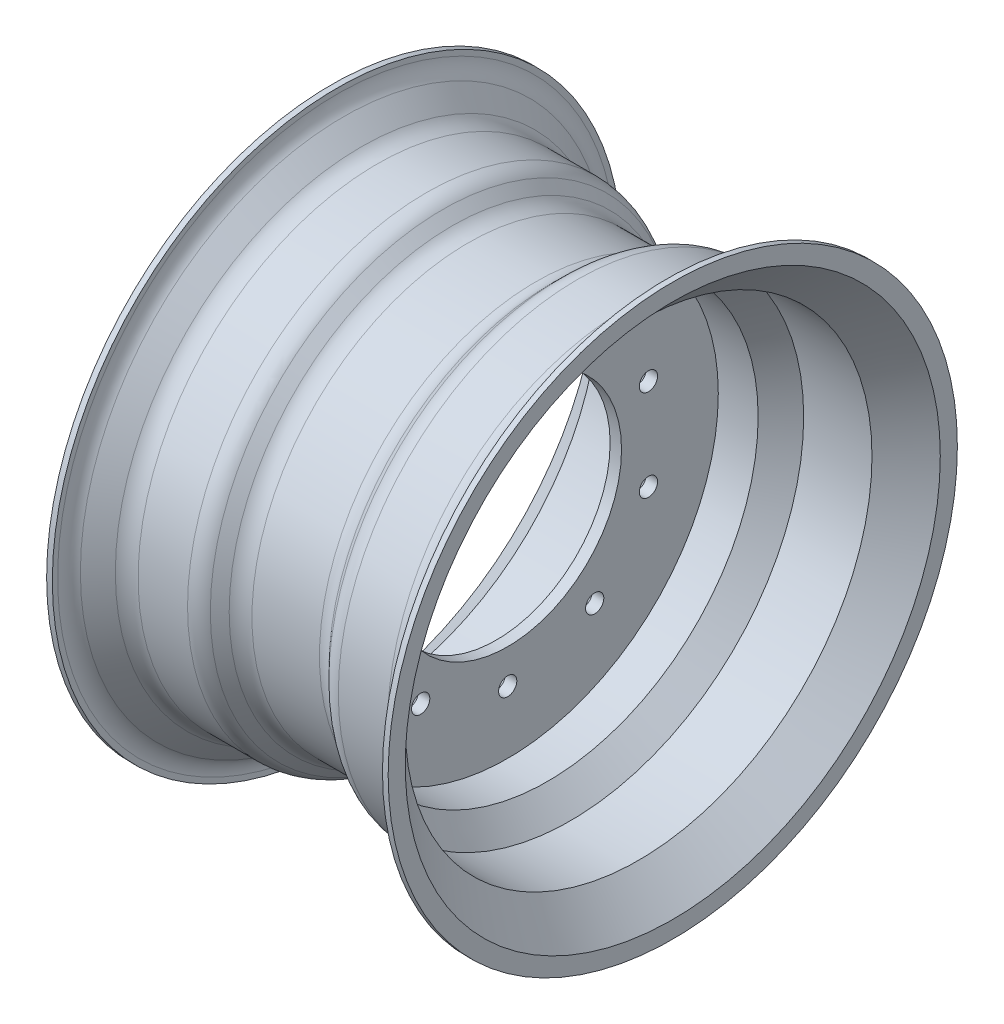
ISO-10303-21;
HEADER;
FILE_DESCRIPTION(('STEP AP214'),'2;1');
FILE_NAME('part.step','',(''),(''),'','','');
FILE_SCHEMA(('AUTOMOTIVE_DESIGN { 1 0 10303 214 1 1 1 1 }'));
ENDSEC;
DATA;
#1=APPLICATION_CONTEXT('core data for automotive mechanical design processes');
#2=APPLICATION_PROTOCOL_DEFINITION('international standard','automotive_design',2000,#1);
#3=PRODUCT_CONTEXT('',#1,'mechanical');
#4=PRODUCT('Part','Part','',(#3));
#5=PRODUCT_RELATED_PRODUCT_CATEGORY('part','',(#4));
#6=PRODUCT_DEFINITION_FORMATION('','',#4);
#7=PRODUCT_DEFINITION_CONTEXT('part definition',#1,'design');
#8=PRODUCT_DEFINITION('design','',#6,#7);
#9=PRODUCT_DEFINITION_SHAPE('','',#8);
#10=(LENGTH_UNIT() NAMED_UNIT(*) SI_UNIT(.MILLI.,.METRE.));
#11=(NAMED_UNIT(*) PLANE_ANGLE_UNIT() SI_UNIT($,.RADIAN.));
#12=(NAMED_UNIT(*) SI_UNIT($,.STERADIAN.) SOLID_ANGLE_UNIT());
#13=UNCERTAINTY_MEASURE_WITH_UNIT(LENGTH_MEASURE(1.E-05),#10,'distance_accuracy_value','');
#14=(GEOMETRIC_REPRESENTATION_CONTEXT(3) GLOBAL_UNCERTAINTY_ASSIGNED_CONTEXT((#13)) GLOBAL_UNIT_ASSIGNED_CONTEXT((#10,
#11,#12)) REPRESENTATION_CONTEXT('',''));
#15=CARTESIAN_POINT('',(0.,0.,0.));
#16=DIRECTION('',(0.,0.,1.));
#17=DIRECTION('',(1.,0.,0.));
#18=AXIS2_PLACEMENT_3D('',#15,#16,#17);
#19=CARTESIAN_POINT('',(0.,0.,0.));
#20=DIRECTION('',(1.,0.,0.));
#21=DIRECTION('',(0.,0.,-1.));
#22=AXIS2_PLACEMENT_3D('',#19,#20,#21);
#23=CYLINDRICAL_SURFACE('',#22,250.);
#24=CARTESIAN_POINT('',(-150.,0.,0.));
#25=DIRECTION('',(1.,0.,0.));
#26=DIRECTION('',(0.,0.,-1.));
#27=AXIS2_PLACEMENT_3D('',#24,#25,#26);
#28=CIRCLE('',#27,250.);
#29=CARTESIAN_POINT('',(-150.,0.,-250.));
#30=VERTEX_POINT('',#29);
#31=EDGE_CURVE('E62',#30,#30,#28,.T.);
#32=ORIENTED_EDGE('',*,*,#31,.T.);
#33=EDGE_LOOP('',(#32));
#34=FACE_BOUND('',#33,.T.);
#35=CARTESIAN_POINT('',(-145.,0.,0.));
#36=DIRECTION('',(1.,0.,0.));
#37=DIRECTION('',(0.,0.,-1.));
#38=AXIS2_PLACEMENT_3D('',#35,#36,#37);
#39=CIRCLE('',#38,250.);
#40=CARTESIAN_POINT('',(-145.,0.,-250.));
#41=VERTEX_POINT('',#40);
#42=EDGE_CURVE('E168',#41,#41,#39,.T.);
#43=ORIENTED_EDGE('',*,*,#42,.F.);
#44=EDGE_LOOP('',(#43));
#45=FACE_BOUND('',#44,.T.);
#46=ADVANCED_FACE('F39',(#34,#45),#23,.T.);
#47=CARTESIAN_POINT('',(-145.,250.,0.));
#48=DIRECTION('',(1.,0.,0.));
#49=DIRECTION('',(0.,0.,-1.));
#50=AXIS2_PLACEMENT_3D('',#47,#48,#49);
#51=PLANE('',#50);
#52=CARTESIAN_POINT('',(-145.,0.,0.));
#53=DIRECTION('',(1.,0.,0.));
#54=DIRECTION('',(0.,0.,-1.));
#55=AXIS2_PLACEMENT_3D('',#52,#53,#54);
#56=CIRCLE('',#55,245.355339059327);
#57=CARTESIAN_POINT('',(-145.,0.,-245.355339059327));
#58=VERTEX_POINT('',#57);
#59=EDGE_CURVE('E10',#58,#58,#56,.F.);
#60=ORIENTED_EDGE('',*,*,#59,.T.);
#61=EDGE_LOOP('',(#60));
#62=FACE_BOUND('',#61,.T.);
#63=ORIENTED_EDGE('',*,*,#42,.T.);
#64=EDGE_LOOP('',(#63));
#65=FACE_BOUND('',#64,.T.);
#66=ADVANCED_FACE('F243',(#62,#65),#51,.T.);
#67=CARTESIAN_POINT('',(-117.928932188134,0.,0.));
#68=DIRECTION('',(-1.,0.,0.));
#69=DIRECTION('',(0.,0.,1.));
#70=AXIS2_PLACEMENT_3D('',#67,#68,#69);
#71=CONICAL_SURFACE('',#70,210.,0.785398163397445);
#72=CARTESIAN_POINT('',(-123.786796564404,0.,0.));
#73=DIRECTION('',(-1.,0.,0.));
#74=DIRECTION('',(0.,0.,1.));
#75=AXIS2_PLACEMENT_3D('',#72,#73,#74);
#76=CIRCLE('',#75,215.857864376269);
#77=CARTESIAN_POINT('',(-123.786796564404,0.,215.857864376269));
#78=VERTEX_POINT('',#77);
#79=EDGE_CURVE('E48',#78,#78,#76,.T.);
#80=ORIENTED_EDGE('',*,*,#79,.T.);
#81=EDGE_LOOP('',(#80));
#82=FACE_BOUND('',#81,.T.);
#83=CARTESIAN_POINT('',(-139.142135623731,0.,0.));
#84=DIRECTION('',(-1.,0.,0.));
#85=DIRECTION('',(0.,0.,1.));
#86=AXIS2_PLACEMENT_3D('',#83,#84,#85);
#87=CIRCLE('',#86,231.213203435596);
#88=CARTESIAN_POINT('',(-139.142135623731,0.,231.213203435596));
#89=VERTEX_POINT('',#88);
#90=EDGE_CURVE('E54',#89,#89,#87,.F.);
#91=ORIENTED_EDGE('',*,*,#90,.T.);
#92=EDGE_LOOP('',(#91));
#93=FACE_BOUND('',#92,.T.);
#94=ADVANCED_FACE('F227',(#82,#93),#71,.T.);
#95=CARTESIAN_POINT('',(0.,0.,0.));
#96=DIRECTION('',(1.,0.,0.));
#97=DIRECTION('',(0.,0.,-1.));
#98=AXIS2_PLACEMENT_3D('',#95,#96,#97);
#99=CYLINDRICAL_SURFACE('',#98,210.);
#100=CARTESIAN_POINT('',(-66.2132034355964,0.,0.));
#101=DIRECTION('',(-1.,0.,0.));
#102=DIRECTION('',(0.,0.,1.));
#103=AXIS2_PLACEMENT_3D('',#100,#101,#102);
#104=CIRCLE('',#103,210.);
#105=CARTESIAN_POINT('',(-66.2132034355964,0.,210.));
#106=VERTEX_POINT('',#105);
#107=EDGE_CURVE('E220',#106,#106,#104,.T.);
#108=ORIENTED_EDGE('',*,*,#107,.T.);
#109=EDGE_LOOP('',(#108));
#110=FACE_BOUND('',#109,.T.);
#111=CARTESIAN_POINT('',(-109.644660940673,0.,0.));
#112=DIRECTION('',(1.,0.,0.));
#113=DIRECTION('',(0.,0.,-1.));
#114=AXIS2_PLACEMENT_3D('',#111,#112,#113);
#115=CIRCLE('',#114,210.);
#116=CARTESIAN_POINT('',(-109.644660940673,0.,-210.));
#117=VERTEX_POINT('',#116);
#118=EDGE_CURVE('E216',#117,#117,#115,.T.);
#119=ORIENTED_EDGE('',*,*,#118,.T.);
#120=EDGE_LOOP('',(#119));
#121=FACE_BOUND('',#120,.T.);
#122=ADVANCED_FACE('F285',(#110,#121),#99,.T.);
#123=CARTESIAN_POINT('',(-37.9289321881345,0.,0.));
#124=DIRECTION('',(-1.,0.,0.));
#125=DIRECTION('',(0.,0.,1.));
#126=AXIS2_PLACEMENT_3D('',#123,#124,#125);
#127=CONICAL_SURFACE('',#126,190.,0.785398163397448);
#128=CARTESIAN_POINT('',(-43.7867965644036,0.,0.));
#129=DIRECTION('',(-1.,0.,0.));
#130=DIRECTION('',(0.,0.,1.));
#131=AXIS2_PLACEMENT_3D('',#128,#129,#130);
#132=CIRCLE('',#131,195.857864376269);
#133=CARTESIAN_POINT('',(-43.7867965644036,0.,195.857864376269));
#134=VERTEX_POINT('',#133);
#135=EDGE_CURVE('E212',#134,#134,#132,.T.);
#136=ORIENTED_EDGE('',*,*,#135,.T.);
#137=EDGE_LOOP('',(#136));
#138=FACE_BOUND('',#137,.T.);
#139=CARTESIAN_POINT('',(-52.0710678118655,0.,0.));
#140=DIRECTION('',(1.,0.,0.));
#141=DIRECTION('',(0.,0.,-1.));
#142=AXIS2_PLACEMENT_3D('',#139,#140,#141);
#143=CIRCLE('',#142,204.142135623731);
#144=CARTESIAN_POINT('',(-52.0710678118655,0.,-204.142135623731));
#145=VERTEX_POINT('',#144);
#146=EDGE_CURVE('E208',#145,#145,#143,.T.);
#147=ORIENTED_EDGE('',*,*,#146,.T.);
#148=EDGE_LOOP('',(#147));
#149=FACE_BOUND('',#148,.T.);
#150=ADVANCED_FACE('F282',(#138,#149),#127,.T.);
#151=CARTESIAN_POINT('',(0.,0.,0.));
#152=DIRECTION('',(1.,0.,0.));
#153=DIRECTION('',(0.,0.,-1.));
#154=AXIS2_PLACEMENT_3D('',#151,#152,#153);
#155=CYLINDRICAL_SURFACE('',#154,190.);
#156=CARTESIAN_POINT('',(29.6446609406726,0.,0.));
#157=DIRECTION('',(1.,0.,0.));
#158=DIRECTION('',(0.,0.,-1.));
#159=AXIS2_PLACEMENT_3D('',#156,#157,#158);
#160=CIRCLE('',#159,190.);
#161=CARTESIAN_POINT('',(29.6446609406726,0.,-190.));
#162=VERTEX_POINT('',#161);
#163=EDGE_CURVE('E204',#162,#162,#160,.F.);
#164=ORIENTED_EDGE('',*,*,#163,.T.);
#165=EDGE_LOOP('',(#164));
#166=FACE_BOUND('',#165,.T.);
#167=CARTESIAN_POINT('',(-29.6446609406726,0.,0.));
#168=DIRECTION('',(1.,0.,0.));
#169=DIRECTION('',(0.,0.,-1.));
#170=AXIS2_PLACEMENT_3D('',#167,#168,#169);
#171=CIRCLE('',#170,190.);
#172=CARTESIAN_POINT('',(-29.6446609406726,0.,-190.));
#173=VERTEX_POINT('',#172);
#174=EDGE_CURVE('E200',#173,#173,#171,.T.);
#175=ORIENTED_EDGE('',*,*,#174,.T.);
#176=EDGE_LOOP('',(#175));
#177=FACE_BOUND('',#176,.T.);
#178=ADVANCED_FACE('F284',(#166,#177),#155,.T.);
#179=CARTESIAN_POINT('',(57.9289321881345,0.,0.));
#180=DIRECTION('',(1.,0.,0.));
#181=DIRECTION('',(0.,0.,-1.));
#182=AXIS2_PLACEMENT_3D('',#179,#180,#181);
#183=CONICAL_SURFACE('',#182,210.,0.785398163397448);
#184=CARTESIAN_POINT('',(52.0710678118655,0.,0.));
#185=DIRECTION('',(-1.,0.,0.));
#186=DIRECTION('',(0.,0.,1.));
#187=AXIS2_PLACEMENT_3D('',#184,#185,#186);
#188=CIRCLE('',#187,204.142135623731);
#189=CARTESIAN_POINT('',(52.0710678118655,0.,204.142135623731));
#190=VERTEX_POINT('',#189);
#191=EDGE_CURVE('E196',#190,#190,#188,.T.);
#192=ORIENTED_EDGE('',*,*,#191,.T.);
#193=EDGE_LOOP('',(#192));
#194=FACE_BOUND('',#193,.T.);
#195=CARTESIAN_POINT('',(43.7867965644036,0.,0.));
#196=DIRECTION('',(1.,0.,0.));
#197=DIRECTION('',(0.,0.,-1.));
#198=AXIS2_PLACEMENT_3D('',#195,#196,#197);
#199=CIRCLE('',#198,195.857864376269);
#200=CARTESIAN_POINT('',(43.7867965644036,0.,-195.857864376269));
#201=VERTEX_POINT('',#200);
#202=EDGE_CURVE('E192',#201,#201,#199,.T.);
#203=ORIENTED_EDGE('',*,*,#202,.T.);
#204=EDGE_LOOP('',(#203));
#205=FACE_BOUND('',#204,.T.);
#206=ADVANCED_FACE('F292',(#194,#205),#183,.T.);
#207=CARTESIAN_POINT('',(0.,0.,0.));
#208=DIRECTION('',(1.,0.,0.));
#209=DIRECTION('',(0.,0.,-1.));
#210=AXIS2_PLACEMENT_3D('',#207,#208,#209);
#211=CYLINDRICAL_SURFACE('',#210,210.);
#212=CARTESIAN_POINT('',(109.644660940673,0.,0.));
#213=DIRECTION('',(1.,0.,0.));
#214=DIRECTION('',(0.,0.,-1.));
#215=AXIS2_PLACEMENT_3D('',#212,#213,#214);
#216=CIRCLE('',#215,210.);
#217=CARTESIAN_POINT('',(109.644660940673,0.,-210.));
#218=VERTEX_POINT('',#217);
#219=EDGE_CURVE('E188',#218,#218,#216,.F.);
#220=ORIENTED_EDGE('',*,*,#219,.T.);
#221=EDGE_LOOP('',(#220));
#222=FACE_BOUND('',#221,.T.);
#223=CARTESIAN_POINT('',(66.2132034355964,0.,0.));
#224=DIRECTION('',(-1.,0.,0.));
#225=DIRECTION('',(0.,0.,1.));
#226=AXIS2_PLACEMENT_3D('',#223,#224,#225);
#227=CIRCLE('',#226,210.);
#228=CARTESIAN_POINT('',(66.2132034355964,0.,210.));
#229=VERTEX_POINT('',#228);
#230=EDGE_CURVE('E184',#229,#229,#227,.F.);
#231=ORIENTED_EDGE('',*,*,#230,.T.);
#232=EDGE_LOOP('',(#231));
#233=FACE_BOUND('',#232,.T.);
#234=ADVANCED_FACE('F372',(#222,#233),#211,.T.);
#235=CARTESIAN_POINT('',(145.,0.,0.));
#236=DIRECTION('',(1.,0.,0.));
#237=DIRECTION('',(0.,0.,-1.));
#238=AXIS2_PLACEMENT_3D('',#235,#236,#237);
#239=CONICAL_SURFACE('',#238,237.071067811865,0.785398163397445);
#240=CARTESIAN_POINT('',(139.142135623731,0.,0.));
#241=DIRECTION('',(1.,0.,0.));
#242=DIRECTION('',(0.,0.,-1.));
#243=AXIS2_PLACEMENT_3D('',#240,#241,#242);
#244=CIRCLE('',#243,231.213203435596);
#245=CARTESIAN_POINT('',(139.142135623731,0.,-231.213203435596));
#246=VERTEX_POINT('',#245);
#247=EDGE_CURVE('E180',#246,#246,#244,.F.);
#248=ORIENTED_EDGE('',*,*,#247,.T.);
#249=EDGE_LOOP('',(#248));
#250=FACE_BOUND('',#249,.T.);
#251=CARTESIAN_POINT('',(123.786796564404,0.,0.));
#252=DIRECTION('',(1.,0.,0.));
#253=DIRECTION('',(0.,0.,-1.));
#254=AXIS2_PLACEMENT_3D('',#251,#252,#253);
#255=CIRCLE('',#254,215.857864376269);
#256=CARTESIAN_POINT('',(123.786796564404,0.,-215.857864376269));
#257=VERTEX_POINT('',#256);
#258=EDGE_CURVE('E176',#257,#257,#255,.T.);
#259=ORIENTED_EDGE('',*,*,#258,.T.);
#260=EDGE_LOOP('',(#259));
#261=FACE_BOUND('',#260,.T.);
#262=ADVANCED_FACE('F380',(#250,#261),#239,.T.);
#263=CARTESIAN_POINT('',(145.,250.,0.));
#264=DIRECTION('',(-1.,0.,0.));
#265=DIRECTION('',(0.,0.,1.));
#266=AXIS2_PLACEMENT_3D('',#263,#264,#265);
#267=PLANE('',#266);
#268=CARTESIAN_POINT('',(145.,0.,0.));
#269=DIRECTION('',(-1.,0.,0.));
#270=DIRECTION('',(0.,0.,1.));
#271=AXIS2_PLACEMENT_3D('',#268,#269,#270);
#272=CIRCLE('',#271,245.355339059327);
#273=CARTESIAN_POINT('',(145.,0.,245.355339059327));
#274=VERTEX_POINT('',#273);
#275=EDGE_CURVE('E172',#274,#274,#272,.F.);
#276=ORIENTED_EDGE('',*,*,#275,.T.);
#277=EDGE_LOOP('',(#276));
#278=FACE_BOUND('',#277,.T.);
#279=CARTESIAN_POINT('',(145.,0.,0.));
#280=DIRECTION('',(1.,0.,0.));
#281=DIRECTION('',(0.,0.,-1.));
#282=AXIS2_PLACEMENT_3D('',#279,#280,#281);
#283=CIRCLE('',#282,250.);
#284=CARTESIAN_POINT('',(145.,0.,-250.));
#285=VERTEX_POINT('',#284);
#286=EDGE_CURVE('E164',#285,#285,#283,.T.);
#287=ORIENTED_EDGE('',*,*,#286,.F.);
#288=EDGE_LOOP('',(#287));
#289=FACE_BOUND('',#288,.T.);
#290=ADVANCED_FACE('F389',(#278,#289),#267,.T.);
#291=CARTESIAN_POINT('',(0.,0.,0.));
#292=DIRECTION('',(1.,0.,0.));
#293=DIRECTION('',(0.,0.,-1.));
#294=AXIS2_PLACEMENT_3D('',#291,#292,#293);
#295=CYLINDRICAL_SURFACE('',#294,250.);
#296=ORIENTED_EDGE('',*,*,#286,.T.);
#297=EDGE_LOOP('',(#296));
#298=FACE_BOUND('',#297,.T.);
#299=CARTESIAN_POINT('',(150.,0.,0.));
#300=DIRECTION('',(1.,0.,0.));
#301=DIRECTION('',(0.,0.,-1.));
#302=AXIS2_PLACEMENT_3D('',#299,#300,#301);
#303=CIRCLE('',#302,250.);
#304=CARTESIAN_POINT('',(150.,0.,-250.));
#305=VERTEX_POINT('',#304);
#306=EDGE_CURVE('E160',#305,#305,#303,.T.);
#307=ORIENTED_EDGE('',*,*,#306,.F.);
#308=EDGE_LOOP('',(#307));
#309=FACE_BOUND('',#308,.T.);
#310=ADVANCED_FACE('F398',(#298,#309),#295,.T.);
#311=CARTESIAN_POINT('',(150.,250.,0.));
#312=DIRECTION('',(1.,0.,0.));
#313=DIRECTION('',(0.,0.,-1.));
#314=AXIS2_PLACEMENT_3D('',#311,#312,#313);
#315=PLANE('',#314);
#316=ORIENTED_EDGE('',*,*,#306,.T.);
#317=EDGE_LOOP('',(#316));
#318=FACE_BOUND('',#317,.T.);
#319=CARTESIAN_POINT('',(150.,0.,0.));
#320=DIRECTION('',(1.,0.,0.));
#321=DIRECTION('',(0.,0.,-1.));
#322=AXIS2_PLACEMENT_3D('',#319,#320,#321);
#323=CIRCLE('',#322,235.);
#324=CARTESIAN_POINT('',(150.,0.,-235.));
#325=VERTEX_POINT('',#324);
#326=EDGE_CURVE('E156',#325,#325,#323,.T.);
#327=ORIENTED_EDGE('',*,*,#326,.F.);
#328=EDGE_LOOP('',(#327));
#329=FACE_BOUND('',#328,.T.);
#330=ADVANCED_FACE('F408',(#318,#329),#315,.T.);
#331=CARTESIAN_POINT('',(120.,0.,0.));
#332=DIRECTION('',(1.,0.,0.));
#333=DIRECTION('',(0.,0.,-1.));
#334=AXIS2_PLACEMENT_3D('',#331,#332,#333);
#335=CONICAL_SURFACE('',#334,205.,0.785398163397446);
#336=ORIENTED_EDGE('',*,*,#326,.T.);
#337=EDGE_LOOP('',(#336));
#338=FACE_BOUND('',#337,.T.);
#339=CARTESIAN_POINT('',(120.,0.,0.));
#340=DIRECTION('',(1.,0.,0.));
#341=DIRECTION('',(0.,0.,-1.));
#342=AXIS2_PLACEMENT_3D('',#339,#340,#341);
#343=CIRCLE('',#342,205.);
#344=CARTESIAN_POINT('',(120.,0.,-205.));
#345=VERTEX_POINT('',#344);
#346=EDGE_CURVE('E152',#345,#345,#343,.T.);
#347=ORIENTED_EDGE('',*,*,#346,.F.);
#348=EDGE_LOOP('',(#347));
#349=FACE_BOUND('',#348,.T.);
#350=ADVANCED_FACE('F417',(#338,#349),#335,.F.);
#351=CARTESIAN_POINT('',(0.,0.,0.));
#352=DIRECTION('',(1.,0.,0.));
#353=DIRECTION('',(0.,0.,-1.));
#354=AXIS2_PLACEMENT_3D('',#351,#352,#353);
#355=CYLINDRICAL_SURFACE('',#354,205.);
#356=ORIENTED_EDGE('',*,*,#346,.T.);
#357=EDGE_LOOP('',(#356));
#358=FACE_BOUND('',#357,.T.);
#359=CARTESIAN_POINT('',(60.,0.,0.));
#360=DIRECTION('',(1.,0.,0.));
#361=DIRECTION('',(0.,0.,-1.));
#362=AXIS2_PLACEMENT_3D('',#359,#360,#361);
#363=CIRCLE('',#362,205.);
#364=CARTESIAN_POINT('',(60.,0.,-205.));
#365=VERTEX_POINT('',#364);
#366=EDGE_CURVE('E148',#365,#365,#363,.T.);
#367=ORIENTED_EDGE('',*,*,#366,.F.);
#368=EDGE_LOOP('',(#367));
#369=FACE_BOUND('',#368,.T.);
#370=ADVANCED_FACE('F426',(#358,#369),#355,.F.);
#371=CARTESIAN_POINT('',(40.,0.,0.));
#372=DIRECTION('',(1.,0.,0.));
#373=DIRECTION('',(0.,0.,-1.));
#374=AXIS2_PLACEMENT_3D('',#371,#372,#373);
#375=CONICAL_SURFACE('',#374,185.,0.785398163397448);
#376=ORIENTED_EDGE('',*,*,#366,.T.);
#377=EDGE_LOOP('',(#376));
#378=FACE_BOUND('',#377,.T.);
#379=CARTESIAN_POINT('',(40.,0.,0.));
#380=DIRECTION('',(1.,0.,0.));
#381=DIRECTION('',(0.,0.,-1.));
#382=AXIS2_PLACEMENT_3D('',#379,#380,#381);
#383=CIRCLE('',#382,185.);
#384=CARTESIAN_POINT('',(40.,0.,-185.));
#385=VERTEX_POINT('',#384);
#386=EDGE_CURVE('E144',#385,#385,#383,.T.);
#387=ORIENTED_EDGE('',*,*,#386,.F.);
#388=EDGE_LOOP('',(#387));
#389=FACE_BOUND('',#388,.T.);
#390=ADVANCED_FACE('F435',(#378,#389),#375,.F.);
#391=CARTESIAN_POINT('',(0.,0.,0.));
#392=DIRECTION('',(1.,0.,0.));
#393=DIRECTION('',(0.,0.,-1.));
#394=AXIS2_PLACEMENT_3D('',#391,#392,#393);
#395=CYLINDRICAL_SURFACE('',#394,185.);
#396=ORIENTED_EDGE('',*,*,#386,.T.);
#397=EDGE_LOOP('',(#396));
#398=FACE_BOUND('',#397,.T.);
#399=CARTESIAN_POINT('',(5.,0.,0.));
#400=DIRECTION('',(1.,0.,0.));
#401=DIRECTION('',(0.,0.,-1.));
#402=AXIS2_PLACEMENT_3D('',#399,#400,#401);
#403=CIRCLE('',#402,185.);
#404=CARTESIAN_POINT('',(5.,0.,-185.));
#405=VERTEX_POINT('',#404);
#406=EDGE_CURVE('E140',#405,#405,#403,.T.);
#407=ORIENTED_EDGE('',*,*,#406,.F.);
#408=EDGE_LOOP('',(#407));
#409=FACE_BOUND('',#408,.T.);
#410=ADVANCED_FACE('F444',(#398,#409),#395,.F.);
#411=CARTESIAN_POINT('',(5.,185.,0.));
#412=DIRECTION('',(1.,0.,0.));
#413=DIRECTION('',(0.,0.,-1.));
#414=AXIS2_PLACEMENT_3D('',#411,#412,#413);
#415=PLANE('',#414);
#416=CARTESIAN_POINT('',(5.,105.172209268744,-76.4120827980201));
#417=DIRECTION('',(1.,0.,0.));
#418=DIRECTION('',(0.,-0.587785252292462,-0.809016994374955));
#419=AXIS2_PLACEMENT_3D('',#416,#417,#418);
#420=CIRCLE('',#419,8.);
#421=CARTESIAN_POINT('',(5.,100.469927250404,-82.8842187530198));
#422=VERTEX_POINT('',#421);
#423=EDGE_CURVE('E636',#422,#422,#420,.T.);
#424=ORIENTED_EDGE('',*,*,#423,.F.);
#425=EDGE_LOOP('',(#424));
#426=FACE_BOUND('',#425,.T.);
#427=CARTESIAN_POINT('',(5.,40.1722092687446,-123.63734711837));
#428=DIRECTION('',(1.,0.,0.));
#429=DIRECTION('',(0.,-0.95105651629515,-0.309016994374958));
#430=AXIS2_PLACEMENT_3D('',#427,#428,#429);
#431=CIRCLE('',#430,8.);
#432=CARTESIAN_POINT('',(5.,32.5637571383834,-126.109483073369));
#433=VERTEX_POINT('',#432);
#434=EDGE_CURVE('E638',#433,#433,#431,.T.);
#435=ORIENTED_EDGE('',*,*,#434,.F.);
#436=EDGE_LOOP('',(#435));
#437=FACE_BOUND('',#436,.T.);
#438=CARTESIAN_POINT('',(5.,-40.172209268742,-123.63734711837));
#439=DIRECTION('',(1.,0.,0.));
#440=DIRECTION('',(0.,-0.951056516295157,0.309016994374938));
#441=AXIS2_PLACEMENT_3D('',#438,#439,#440);
#442=CIRCLE('',#441,8.);
#443=CARTESIAN_POINT('',(5.,-47.7806613991032,-121.165211163371));
#444=VERTEX_POINT('',#443);
#445=EDGE_CURVE('E641',#444,#444,#442,.T.);
#446=ORIENTED_EDGE('',*,*,#445,.F.);
#447=EDGE_LOOP('',(#446));
#448=FACE_BOUND('',#447,.T.);
#449=CARTESIAN_POINT('',(5.,-105.172209268742,-76.4120827980224));
#450=DIRECTION('',(1.,0.,0.));
#451=DIRECTION('',(0.,-0.58778525229248,0.809016994374942));
#452=AXIS2_PLACEMENT_3D('',#449,#450,#451);
#453=CIRCLE('',#452,8.);
#454=CARTESIAN_POINT('',(5.,-109.874491287082,-69.9399468430229));
#455=VERTEX_POINT('',#454);
#456=EDGE_CURVE('E647',#455,#455,#453,.T.);
#457=ORIENTED_EDGE('',*,*,#456,.F.);
#458=EDGE_LOOP('',(#457));
#459=FACE_BOUND('',#458,.T.);
#460=CARTESIAN_POINT('',(5.,-130.,0.));
#461=DIRECTION('',(1.,0.,0.));
#462=DIRECTION('',(0.,0.,1.));
#463=AXIS2_PLACEMENT_3D('',#460,#461,#462);
#464=CIRCLE('',#463,8.);
#465=CARTESIAN_POINT('',(5.,-130.,8.));
#466=VERTEX_POINT('',#465);
#467=EDGE_CURVE('E651',#466,#466,#464,.T.);
#468=ORIENTED_EDGE('',*,*,#467,.F.);
#469=EDGE_LOOP('',(#468));
#470=FACE_BOUND('',#469,.T.);
#471=CARTESIAN_POINT('',(5.,-105.172209268744,76.4120827980209));
#472=DIRECTION('',(1.,0.,0.));
#473=DIRECTION('',(0.,0.587785252292469,0.809016994374951));
#474=AXIS2_PLACEMENT_3D('',#471,#472,#473);
#475=CIRCLE('',#474,8.);
#476=CARTESIAN_POINT('',(5.,-100.469927250404,82.8842187530205));
#477=VERTEX_POINT('',#476);
#478=EDGE_CURVE('E655',#477,#477,#475,.T.);
#479=ORIENTED_EDGE('',*,*,#478,.F.);
#480=EDGE_LOOP('',(#479));
#481=FACE_BOUND('',#480,.T.);
#482=CARTESIAN_POINT('',(5.,-40.1722092687437,123.63734711837));
#483=DIRECTION('',(1.,0.,0.));
#484=DIRECTION('',(0.,0.951056516295152,0.309016994374952));
#485=AXIS2_PLACEMENT_3D('',#482,#483,#484);
#486=CIRCLE('',#485,8.);
#487=CARTESIAN_POINT('',(5.,-32.5637571383825,126.109483073369));
#488=VERTEX_POINT('',#487);
#489=EDGE_CURVE('E659',#488,#488,#486,.T.);
#490=ORIENTED_EDGE('',*,*,#489,.F.);
#491=EDGE_LOOP('',(#490));
#492=FACE_BOUND('',#491,.T.);
#493=CARTESIAN_POINT('',(5.,40.1722092687428,123.63734711837));
#494=DIRECTION('',(1.,0.,0.));
#495=DIRECTION('',(0.,0.951056516295155,-0.309016994374945));
#496=AXIS2_PLACEMENT_3D('',#493,#494,#495);
#497=CIRCLE('',#496,8.);
#498=CARTESIAN_POINT('',(5.,47.7806613991041,121.165211163371));
#499=VERTEX_POINT('',#498);
#500=EDGE_CURVE('E663',#499,#499,#497,.T.);
#501=ORIENTED_EDGE('',*,*,#500,.F.);
#502=EDGE_LOOP('',(#501));
#503=FACE_BOUND('',#502,.T.);
#504=CARTESIAN_POINT('',(5.,105.172209268743,76.4120827980217));
#505=DIRECTION('',(1.,0.,0.));
#506=DIRECTION('',(0.,0.587785252292474,-0.809016994374947));
#507=AXIS2_PLACEMENT_3D('',#504,#505,#506);
#508=CIRCLE('',#507,8.);
#509=CARTESIAN_POINT('',(5.,109.874491287083,69.9399468430221));
#510=VERTEX_POINT('',#509);
#511=EDGE_CURVE('E69',#510,#510,#508,.T.);
#512=ORIENTED_EDGE('',*,*,#511,.F.);
#513=EDGE_LOOP('',(#512));
#514=FACE_BOUND('',#513,.T.);
#515=CARTESIAN_POINT('',(5.,130.,0.));
#516=DIRECTION('',(1.,0.,0.));
#517=DIRECTION('',(0.,0.,-1.));
#518=AXIS2_PLACEMENT_3D('',#515,#516,#517);
#519=CIRCLE('',#518,8.);
#520=CARTESIAN_POINT('',(5.,130.,-8.));
#521=VERTEX_POINT('',#520);
#522=EDGE_CURVE('E63',#521,#521,#519,.T.);
#523=ORIENTED_EDGE('',*,*,#522,.F.);
#524=EDGE_LOOP('',(#523));
#525=FACE_BOUND('',#524,.T.);
#526=ORIENTED_EDGE('',*,*,#406,.T.);
#527=EDGE_LOOP('',(#526));
#528=FACE_BOUND('',#527,.T.);
#529=CARTESIAN_POINT('',(5.00000000000001,0.,0.));
#530=DIRECTION('',(1.,0.,0.));
#531=DIRECTION('',(0.,0.,-1.));
#532=AXIS2_PLACEMENT_3D('',#529,#530,#531);
#533=CIRCLE('',#532,100.);
#534=CARTESIAN_POINT('',(5.00000000000001,0.,-100.));
#535=VERTEX_POINT('',#534);
#536=EDGE_CURVE('E136',#535,#535,#533,.T.);
#537=ORIENTED_EDGE('',*,*,#536,.F.);
#538=EDGE_LOOP('',(#537));
#539=FACE_BOUND('',#538,.T.);
#540=ADVANCED_FACE('F453',(#426,#437,#448,#459,#470,#481,#492,#503,#514,#525,#528,#539),#415,.T.);
#541=CARTESIAN_POINT('',(0.,0.,0.));
#542=DIRECTION('',(1.,0.,0.));
#543=DIRECTION('',(0.,0.,-1.));
#544=AXIS2_PLACEMENT_3D('',#541,#542,#543);
#545=CYLINDRICAL_SURFACE('',#544,100.);
#546=ORIENTED_EDGE('',*,*,#536,.T.);
#547=EDGE_LOOP('',(#546));
#548=FACE_BOUND('',#547,.T.);
#549=CARTESIAN_POINT('',(-4.99999999999999,0.,0.));
#550=DIRECTION('',(1.,0.,0.));
#551=DIRECTION('',(0.,0.,-1.));
#552=AXIS2_PLACEMENT_3D('',#549,#550,#551);
#553=CIRCLE('',#552,100.);
#554=CARTESIAN_POINT('',(-4.99999999999999,0.,-100.));
#555=VERTEX_POINT('',#554);
#556=EDGE_CURVE('E132',#555,#555,#553,.T.);
#557=ORIENTED_EDGE('',*,*,#556,.F.);
#558=EDGE_LOOP('',(#557));
#559=FACE_BOUND('',#558,.T.);
#560=ADVANCED_FACE('F463',(#548,#559),#545,.F.);
#561=CARTESIAN_POINT('',(-4.99999999999999,185.,0.));
#562=DIRECTION('',(-1.,0.,0.));
#563=DIRECTION('',(0.,0.,1.));
#564=AXIS2_PLACEMENT_3D('',#561,#562,#563);
#565=PLANE('',#564);
#566=CARTESIAN_POINT('',(-5.,105.172209268744,-76.4120827980201));
#567=DIRECTION('',(-1.,0.,0.));
#568=DIRECTION('',(0.,0.,1.));
#569=AXIS2_PLACEMENT_3D('',#566,#567,#568);
#570=CIRCLE('',#569,8.);
#571=CARTESIAN_POINT('',(-5.,105.172209268744,-68.4120827980201));
#572=VERTEX_POINT('',#571);
#573=EDGE_CURVE('E43',#572,#572,#570,.T.);
#574=ORIENTED_EDGE('',*,*,#573,.F.);
#575=EDGE_LOOP('',(#574));
#576=FACE_BOUND('',#575,.T.);
#577=CARTESIAN_POINT('',(-5.,40.1722092687446,-123.63734711837));
#578=DIRECTION('',(-1.,0.,0.));
#579=DIRECTION('',(0.,0.,1.));
#580=AXIS2_PLACEMENT_3D('',#577,#578,#579);
#581=CIRCLE('',#580,8.);
#582=CARTESIAN_POINT('',(-5.,40.1722092687446,-115.63734711837));
#583=VERTEX_POINT('',#582);
#584=EDGE_CURVE('E92',#583,#583,#581,.T.);
#585=ORIENTED_EDGE('',*,*,#584,.F.);
#586=EDGE_LOOP('',(#585));
#587=FACE_BOUND('',#586,.T.);
#588=CARTESIAN_POINT('',(-5.,-40.172209268742,-123.63734711837));
#589=DIRECTION('',(-1.,0.,0.));
#590=DIRECTION('',(0.,0.,1.));
#591=AXIS2_PLACEMENT_3D('',#588,#589,#590);
#592=CIRCLE('',#591,8.);
#593=CARTESIAN_POINT('',(-5.,-40.172209268742,-115.63734711837));
#594=VERTEX_POINT('',#593);
#595=EDGE_CURVE('E89',#594,#594,#592,.T.);
#596=ORIENTED_EDGE('',*,*,#595,.F.);
#597=EDGE_LOOP('',(#596));
#598=FACE_BOUND('',#597,.T.);
#599=CARTESIAN_POINT('',(-5.,-105.172209268742,-76.4120827980224));
#600=DIRECTION('',(-1.,0.,0.));
#601=DIRECTION('',(0.,0.,1.));
#602=AXIS2_PLACEMENT_3D('',#599,#600,#601);
#603=CIRCLE('',#602,8.);
#604=CARTESIAN_POINT('',(-5.,-105.172209268742,-68.4120827980224));
#605=VERTEX_POINT('',#604);
#606=EDGE_CURVE('E85',#605,#605,#603,.T.);
#607=ORIENTED_EDGE('',*,*,#606,.F.);
#608=EDGE_LOOP('',(#607));
#609=FACE_BOUND('',#608,.T.);
#610=CARTESIAN_POINT('',(-5.,-130.,0.));
#611=DIRECTION('',(-1.,0.,0.));
#612=DIRECTION('',(0.,0.,1.));
#613=AXIS2_PLACEMENT_3D('',#610,#611,#612);
#614=CIRCLE('',#613,8.);
#615=CARTESIAN_POINT('',(-5.,-130.,8.));
#616=VERTEX_POINT('',#615);
#617=EDGE_CURVE('E81',#616,#616,#614,.T.);
#618=ORIENTED_EDGE('',*,*,#617,.F.);
#619=EDGE_LOOP('',(#618));
#620=FACE_BOUND('',#619,.T.);
#621=CARTESIAN_POINT('',(-5.,-105.172209268744,76.4120827980209));
#622=DIRECTION('',(-1.,0.,0.));
#623=DIRECTION('',(0.,0.,1.));
#624=AXIS2_PLACEMENT_3D('',#621,#622,#623);
#625=CIRCLE('',#624,8.);
#626=CARTESIAN_POINT('',(-5.,-105.172209268744,84.4120827980209));
#627=VERTEX_POINT('',#626);
#628=EDGE_CURVE('E77',#627,#627,#625,.T.);
#629=ORIENTED_EDGE('',*,*,#628,.F.);
#630=EDGE_LOOP('',(#629));
#631=FACE_BOUND('',#630,.T.);
#632=CARTESIAN_POINT('',(-5.,-40.1722092687437,123.63734711837));
#633=DIRECTION('',(-1.,0.,0.));
#634=DIRECTION('',(0.,0.,1.));
#635=AXIS2_PLACEMENT_3D('',#632,#633,#634);
#636=CIRCLE('',#635,8.);
#637=CARTESIAN_POINT('',(-5.,-40.1722092687437,131.63734711837));
#638=VERTEX_POINT('',#637);
#639=EDGE_CURVE('E73',#638,#638,#636,.T.);
#640=ORIENTED_EDGE('',*,*,#639,.F.);
#641=EDGE_LOOP('',(#640));
#642=FACE_BOUND('',#641,.T.);
#643=CARTESIAN_POINT('',(-5.,40.1722092687428,123.63734711837));
#644=DIRECTION('',(-1.,0.,0.));
#645=DIRECTION('',(0.,0.,1.));
#646=AXIS2_PLACEMENT_3D('',#643,#644,#645);
#647=CIRCLE('',#646,8.);
#648=CARTESIAN_POINT('',(-5.,40.1722092687428,131.63734711837));
#649=VERTEX_POINT('',#648);
#650=EDGE_CURVE('E68',#649,#649,#647,.T.);
#651=ORIENTED_EDGE('',*,*,#650,.F.);
#652=EDGE_LOOP('',(#651));
#653=FACE_BOUND('',#652,.T.);
#654=CARTESIAN_POINT('',(-5.,105.172209268743,76.4120827980217));
#655=DIRECTION('',(-1.,0.,0.));
#656=DIRECTION('',(0.,0.,1.));
#657=AXIS2_PLACEMENT_3D('',#654,#655,#656);
#658=CIRCLE('',#657,8.);
#659=CARTESIAN_POINT('',(-5.,105.172209268743,84.4120827980217));
#660=VERTEX_POINT('',#659);
#661=EDGE_CURVE('E64',#660,#660,#658,.T.);
#662=ORIENTED_EDGE('',*,*,#661,.F.);
#663=EDGE_LOOP('',(#662));
#664=FACE_BOUND('',#663,.T.);
#665=CARTESIAN_POINT('',(-5.,130.,0.));
#666=DIRECTION('',(-1.,0.,0.));
#667=DIRECTION('',(0.,0.,1.));
#668=AXIS2_PLACEMENT_3D('',#665,#666,#667);
#669=CIRCLE('',#668,8.);
#670=CARTESIAN_POINT('',(-5.,130.,8.));
#671=VERTEX_POINT('',#670);
#672=EDGE_CURVE('E58',#671,#671,#669,.T.);
#673=ORIENTED_EDGE('',*,*,#672,.F.);
#674=EDGE_LOOP('',(#673));
#675=FACE_BOUND('',#674,.T.);
#676=ORIENTED_EDGE('',*,*,#556,.T.);
#677=EDGE_LOOP('',(#676));
#678=FACE_BOUND('',#677,.T.);
#679=CARTESIAN_POINT('',(-5.,0.,0.));
#680=DIRECTION('',(1.,0.,0.));
#681=DIRECTION('',(0.,0.,-1.));
#682=AXIS2_PLACEMENT_3D('',#679,#680,#681);
#683=CIRCLE('',#682,185.);
#684=CARTESIAN_POINT('',(-5.,0.,-185.));
#685=VERTEX_POINT('',#684);
#686=EDGE_CURVE('E128',#685,#685,#683,.T.);
#687=ORIENTED_EDGE('',*,*,#686,.F.);
#688=EDGE_LOOP('',(#687));
#689=FACE_BOUND('',#688,.T.);
#690=ADVANCED_FACE('F472',(#576,#587,#598,#609,#620,#631,#642,#653,#664,#675,#678,#689),#565,.T.);
#691=CARTESIAN_POINT('',(0.,0.,0.));
#692=DIRECTION('',(1.,0.,0.));
#693=DIRECTION('',(0.,0.,-1.));
#694=AXIS2_PLACEMENT_3D('',#691,#692,#693);
#695=CYLINDRICAL_SURFACE('',#694,185.);
#696=ORIENTED_EDGE('',*,*,#686,.T.);
#697=EDGE_LOOP('',(#696));
#698=FACE_BOUND('',#697,.T.);
#699=CARTESIAN_POINT('',(-40.,0.,0.));
#700=DIRECTION('',(1.,0.,0.));
#701=DIRECTION('',(0.,0.,-1.));
#702=AXIS2_PLACEMENT_3D('',#699,#700,#701);
#703=CIRCLE('',#702,185.);
#704=CARTESIAN_POINT('',(-40.,0.,-185.));
#705=VERTEX_POINT('',#704);
#706=EDGE_CURVE('E124',#705,#705,#703,.T.);
#707=ORIENTED_EDGE('',*,*,#706,.F.);
#708=EDGE_LOOP('',(#707));
#709=FACE_BOUND('',#708,.T.);
#710=ADVANCED_FACE('F481',(#698,#709),#695,.F.);
#711=CARTESIAN_POINT('',(-60.,0.,0.));
#712=DIRECTION('',(-1.,0.,0.));
#713=DIRECTION('',(0.,0.,1.));
#714=AXIS2_PLACEMENT_3D('',#711,#712,#713);
#715=CONICAL_SURFACE('',#714,205.,0.785398163397448);
#716=ORIENTED_EDGE('',*,*,#706,.T.);
#717=EDGE_LOOP('',(#716));
#718=FACE_BOUND('',#717,.T.);
#719=CARTESIAN_POINT('',(-60.,0.,0.));
#720=DIRECTION('',(1.,0.,0.));
#721=DIRECTION('',(0.,0.,-1.));
#722=AXIS2_PLACEMENT_3D('',#719,#720,#721);
#723=CIRCLE('',#722,205.);
#724=CARTESIAN_POINT('',(-60.,0.,-205.));
#725=VERTEX_POINT('',#724);
#726=EDGE_CURVE('E120',#725,#725,#723,.T.);
#727=ORIENTED_EDGE('',*,*,#726,.F.);
#728=EDGE_LOOP('',(#727));
#729=FACE_BOUND('',#728,.T.);
#730=ADVANCED_FACE('F325',(#718,#729),#715,.F.);
#731=CARTESIAN_POINT('',(0.,0.,0.));
#732=DIRECTION('',(1.,0.,0.));
#733=DIRECTION('',(0.,0.,-1.));
#734=AXIS2_PLACEMENT_3D('',#731,#732,#733);
#735=CYLINDRICAL_SURFACE('',#734,205.);
#736=ORIENTED_EDGE('',*,*,#726,.T.);
#737=EDGE_LOOP('',(#736));
#738=FACE_BOUND('',#737,.T.);
#739=CARTESIAN_POINT('',(-120.,0.,0.));
#740=DIRECTION('',(1.,0.,0.));
#741=DIRECTION('',(0.,0.,-1.));
#742=AXIS2_PLACEMENT_3D('',#739,#740,#741);
#743=CIRCLE('',#742,205.);
#744=CARTESIAN_POINT('',(-120.,0.,-205.));
#745=VERTEX_POINT('',#744);
#746=EDGE_CURVE('E116',#745,#745,#743,.T.);
#747=ORIENTED_EDGE('',*,*,#746,.F.);
#748=EDGE_LOOP('',(#747));
#749=FACE_BOUND('',#748,.T.);
#750=ADVANCED_FACE('F322',(#738,#749),#735,.F.);
#751=CARTESIAN_POINT('',(-150.,0.,0.));
#752=DIRECTION('',(-1.,0.,0.));
#753=DIRECTION('',(0.,0.,1.));
#754=AXIS2_PLACEMENT_3D('',#751,#752,#753);
#755=CONICAL_SURFACE('',#754,235.,0.785398163397446);
#756=ORIENTED_EDGE('',*,*,#746,.T.);
#757=EDGE_LOOP('',(#756));
#758=FACE_BOUND('',#757,.T.);
#759=CARTESIAN_POINT('',(-150.,0.,0.));
#760=DIRECTION('',(1.,0.,0.));
#761=DIRECTION('',(0.,0.,-1.));
#762=AXIS2_PLACEMENT_3D('',#759,#760,#761);
#763=CIRCLE('',#762,235.);
#764=CARTESIAN_POINT('',(-150.,0.,-235.));
#765=VERTEX_POINT('',#764);
#766=EDGE_CURVE('E112',#765,#765,#763,.T.);
#767=ORIENTED_EDGE('',*,*,#766,.F.);
#768=EDGE_LOOP('',(#767));
#769=FACE_BOUND('',#768,.T.);
#770=ADVANCED_FACE('F318',(#758,#769),#755,.F.);
#771=CARTESIAN_POINT('',(-150.,250.,0.));
#772=DIRECTION('',(-1.,0.,0.));
#773=DIRECTION('',(0.,0.,1.));
#774=AXIS2_PLACEMENT_3D('',#771,#772,#773);
#775=PLANE('',#774);
#776=ORIENTED_EDGE('',*,*,#766,.T.);
#777=EDGE_LOOP('',(#776));
#778=FACE_BOUND('',#777,.T.);
#779=ORIENTED_EDGE('',*,*,#31,.F.);
#780=EDGE_LOOP('',(#779));
#781=FACE_BOUND('',#780,.T.);
#782=ADVANCED_FACE('F257',(#778,#781),#775,.T.);
#783=CARTESIAN_POINT('',(125.,0.,0.));
#784=DIRECTION('',(-1.,0.,0.));
#785=DIRECTION('',(0.,0.,1.));
#786=AXIS2_PLACEMENT_3D('',#783,#784,#785);
#787=TOROIDAL_SURFACE('',#786,245.355339059327,20.);
#788=ORIENTED_EDGE('',*,*,#247,.F.);
#789=EDGE_LOOP('',(#788));
#790=FACE_BOUND('',#789,.T.);
#791=ORIENTED_EDGE('',*,*,#275,.F.);
#792=EDGE_LOOP('',(#791));
#793=FACE_BOUND('',#792,.T.);
#794=ADVANCED_FACE('F253',(#790,#793),#787,.F.);
#795=CARTESIAN_POINT('',(109.644660940673,0.,0.));
#796=DIRECTION('',(1.,0.,0.));
#797=DIRECTION('',(0.,0.,-1.));
#798=AXIS2_PLACEMENT_3D('',#795,#796,#797);
#799=TOROIDAL_SURFACE('',#798,230.,20.);
#800=ORIENTED_EDGE('',*,*,#219,.F.);
#801=EDGE_LOOP('',(#800));
#802=FACE_BOUND('',#801,.T.);
#803=ORIENTED_EDGE('',*,*,#258,.F.);
#804=EDGE_LOOP('',(#803));
#805=FACE_BOUND('',#804,.T.);
#806=ADVANCED_FACE('F256',(#802,#805),#799,.F.);
#807=CARTESIAN_POINT('',(66.2132034355964,0.,0.));
#808=DIRECTION('',(-1.,0.,0.));
#809=DIRECTION('',(0.,0.,1.));
#810=AXIS2_PLACEMENT_3D('',#807,#808,#809);
#811=TOROIDAL_SURFACE('',#810,190.,20.);
#812=ORIENTED_EDGE('',*,*,#191,.F.);
#813=EDGE_LOOP('',(#812));
#814=FACE_BOUND('',#813,.T.);
#815=ORIENTED_EDGE('',*,*,#230,.F.);
#816=EDGE_LOOP('',(#815));
#817=FACE_BOUND('',#816,.T.);
#818=ADVANCED_FACE('F261',(#814,#817),#811,.T.);
#819=CARTESIAN_POINT('',(29.6446609406726,0.,0.));
#820=DIRECTION('',(1.,0.,0.));
#821=DIRECTION('',(0.,0.,-1.));
#822=AXIS2_PLACEMENT_3D('',#819,#820,#821);
#823=TOROIDAL_SURFACE('',#822,210.,20.);
#824=ORIENTED_EDGE('',*,*,#163,.F.);
#825=EDGE_LOOP('',(#824));
#826=FACE_BOUND('',#825,.T.);
#827=ORIENTED_EDGE('',*,*,#202,.F.);
#828=EDGE_LOOP('',(#827));
#829=FACE_BOUND('',#828,.T.);
#830=ADVANCED_FACE('F265',(#826,#829),#823,.F.);
#831=CARTESIAN_POINT('',(-29.6446609406726,0.,0.));
#832=DIRECTION('',(1.,0.,0.));
#833=DIRECTION('',(0.,0.,-1.));
#834=AXIS2_PLACEMENT_3D('',#831,#832,#833);
#835=TOROIDAL_SURFACE('',#834,210.,20.);
#836=ORIENTED_EDGE('',*,*,#135,.F.);
#837=EDGE_LOOP('',(#836));
#838=FACE_BOUND('',#837,.T.);
#839=ORIENTED_EDGE('',*,*,#174,.F.);
#840=EDGE_LOOP('',(#839));
#841=FACE_BOUND('',#840,.T.);
#842=ADVANCED_FACE('F269',(#838,#841),#835,.F.);
#843=CARTESIAN_POINT('',(-66.2132034355964,0.,0.));
#844=DIRECTION('',(-1.,0.,0.));
#845=DIRECTION('',(0.,0.,1.));
#846=AXIS2_PLACEMENT_3D('',#843,#844,#845);
#847=TOROIDAL_SURFACE('',#846,190.,20.);
#848=ORIENTED_EDGE('',*,*,#107,.F.);
#849=EDGE_LOOP('',(#848));
#850=FACE_BOUND('',#849,.T.);
#851=ORIENTED_EDGE('',*,*,#146,.F.);
#852=EDGE_LOOP('',(#851));
#853=FACE_BOUND('',#852,.T.);
#854=ADVANCED_FACE('F240',(#850,#853),#847,.T.);
#855=CARTESIAN_POINT('',(-109.644660940673,0.,0.));
#856=DIRECTION('',(1.,0.,0.));
#857=DIRECTION('',(0.,0.,-1.));
#858=AXIS2_PLACEMENT_3D('',#855,#856,#857);
#859=TOROIDAL_SURFACE('',#858,230.,20.);
#860=ORIENTED_EDGE('',*,*,#79,.F.);
#861=EDGE_LOOP('',(#860));
#862=FACE_BOUND('',#861,.T.);
#863=ORIENTED_EDGE('',*,*,#118,.F.);
#864=EDGE_LOOP('',(#863));
#865=FACE_BOUND('',#864,.T.);
#866=ADVANCED_FACE('F231',(#862,#865),#859,.F.);
#867=CARTESIAN_POINT('',(-125.,0.,0.));
#868=DIRECTION('',(1.,0.,0.));
#869=DIRECTION('',(0.,0.,-1.));
#870=AXIS2_PLACEMENT_3D('',#867,#868,#869);
#871=TOROIDAL_SURFACE('',#870,245.355339059327,20.);
#872=ORIENTED_EDGE('',*,*,#59,.F.);
#873=EDGE_LOOP('',(#872));
#874=FACE_BOUND('',#873,.T.);
#875=ORIENTED_EDGE('',*,*,#90,.F.);
#876=EDGE_LOOP('',(#875));
#877=FACE_BOUND('',#876,.T.);
#878=ADVANCED_FACE('F41',(#874,#877),#871,.F.);
#879=CARTESIAN_POINT('',(-150.,130.,0.));
#880=DIRECTION('',(1.,0.,0.));
#881=DIRECTION('',(0.,0.,-1.));
#882=AXIS2_PLACEMENT_3D('',#879,#880,#881);
#883=CYLINDRICAL_SURFACE('',#882,8.);
#884=ORIENTED_EDGE('',*,*,#672,.T.);
#885=EDGE_LOOP('',(#884));
#886=FACE_BOUND('',#885,.T.);
#887=ORIENTED_EDGE('',*,*,#522,.T.);
#888=EDGE_LOOP('',(#887));
#889=FACE_BOUND('',#888,.T.);
#890=ADVANCED_FACE('F230',(#886,#889),#883,.F.);
#891=CARTESIAN_POINT('',(-150.,105.172209268743,76.4120827980217));
#892=DIRECTION('',(1.,0.,0.));
#893=DIRECTION('',(0.,0.,-1.));
#894=AXIS2_PLACEMENT_3D('',#891,#892,#893);
#895=CYLINDRICAL_SURFACE('',#894,8.);
#896=ORIENTED_EDGE('',*,*,#661,.T.);
#897=EDGE_LOOP('',(#896));
#898=FACE_BOUND('',#897,.T.);
#899=ORIENTED_EDGE('',*,*,#511,.T.);
#900=EDGE_LOOP('',(#899));
#901=FACE_BOUND('',#900,.T.);
#902=ADVANCED_FACE('F237',(#898,#901),#895,.F.);
#903=CARTESIAN_POINT('',(-150.,40.1722092687428,123.63734711837));
#904=DIRECTION('',(1.,0.,0.));
#905=DIRECTION('',(0.,0.,-1.));
#906=AXIS2_PLACEMENT_3D('',#903,#904,#905);
#907=CYLINDRICAL_SURFACE('',#906,8.);
#908=ORIENTED_EDGE('',*,*,#650,.T.);
#909=EDGE_LOOP('',(#908));
#910=FACE_BOUND('',#909,.T.);
#911=ORIENTED_EDGE('',*,*,#500,.T.);
#912=EDGE_LOOP('',(#911));
#913=FACE_BOUND('',#912,.T.);
#914=ADVANCED_FACE('F551',(#910,#913),#907,.F.);
#915=CARTESIAN_POINT('',(-150.,-40.1722092687437,123.63734711837));
#916=DIRECTION('',(1.,0.,0.));
#917=DIRECTION('',(0.,0.,-1.));
#918=AXIS2_PLACEMENT_3D('',#915,#916,#917);
#919=CYLINDRICAL_SURFACE('',#918,8.);
#920=ORIENTED_EDGE('',*,*,#639,.T.);
#921=EDGE_LOOP('',(#920));
#922=FACE_BOUND('',#921,.T.);
#923=ORIENTED_EDGE('',*,*,#489,.T.);
#924=EDGE_LOOP('',(#923));
#925=FACE_BOUND('',#924,.T.);
#926=ADVANCED_FACE('F560',(#922,#925),#919,.F.);
#927=CARTESIAN_POINT('',(-150.,-105.172209268744,76.4120827980209));
#928=DIRECTION('',(1.,0.,0.));
#929=DIRECTION('',(0.,0.,-1.));
#930=AXIS2_PLACEMENT_3D('',#927,#928,#929);
#931=CYLINDRICAL_SURFACE('',#930,8.);
#932=ORIENTED_EDGE('',*,*,#628,.T.);
#933=EDGE_LOOP('',(#932));
#934=FACE_BOUND('',#933,.T.);
#935=ORIENTED_EDGE('',*,*,#478,.T.);
#936=EDGE_LOOP('',(#935));
#937=FACE_BOUND('',#936,.T.);
#938=ADVANCED_FACE('F569',(#934,#937),#931,.F.);
#939=CARTESIAN_POINT('',(-150.,-130.,0.));
#940=DIRECTION('',(1.,0.,0.));
#941=DIRECTION('',(0.,0.,-1.));
#942=AXIS2_PLACEMENT_3D('',#939,#940,#941);
#943=CYLINDRICAL_SURFACE('',#942,8.);
#944=ORIENTED_EDGE('',*,*,#617,.T.);
#945=EDGE_LOOP('',(#944));
#946=FACE_BOUND('',#945,.T.);
#947=ORIENTED_EDGE('',*,*,#467,.T.);
#948=EDGE_LOOP('',(#947));
#949=FACE_BOUND('',#948,.T.);
#950=ADVANCED_FACE('F578',(#946,#949),#943,.F.);
#951=CARTESIAN_POINT('',(-150.,-105.172209268742,-76.4120827980224));
#952=DIRECTION('',(1.,0.,0.));
#953=DIRECTION('',(0.,0.,-1.));
#954=AXIS2_PLACEMENT_3D('',#951,#952,#953);
#955=CYLINDRICAL_SURFACE('',#954,8.);
#956=ORIENTED_EDGE('',*,*,#606,.T.);
#957=EDGE_LOOP('',(#956));
#958=FACE_BOUND('',#957,.T.);
#959=ORIENTED_EDGE('',*,*,#456,.T.);
#960=EDGE_LOOP('',(#959));
#961=FACE_BOUND('',#960,.T.);
#962=ADVANCED_FACE('F587',(#958,#961),#955,.F.);
#963=CARTESIAN_POINT('',(-150.,-40.172209268742,-123.63734711837));
#964=DIRECTION('',(1.,0.,0.));
#965=DIRECTION('',(0.,0.,-1.));
#966=AXIS2_PLACEMENT_3D('',#963,#964,#965);
#967=CYLINDRICAL_SURFACE('',#966,8.);
#968=ORIENTED_EDGE('',*,*,#595,.T.);
#969=EDGE_LOOP('',(#968));
#970=FACE_BOUND('',#969,.T.);
#971=ORIENTED_EDGE('',*,*,#445,.T.);
#972=EDGE_LOOP('',(#971));
#973=FACE_BOUND('',#972,.T.);
#974=ADVANCED_FACE('F596',(#970,#973),#967,.F.);
#975=CARTESIAN_POINT('',(-150.,40.1722092687446,-123.63734711837));
#976=DIRECTION('',(1.,0.,0.));
#977=DIRECTION('',(0.,0.,-1.));
#978=AXIS2_PLACEMENT_3D('',#975,#976,#977);
#979=CYLINDRICAL_SURFACE('',#978,8.);
#980=ORIENTED_EDGE('',*,*,#584,.T.);
#981=EDGE_LOOP('',(#980));
#982=FACE_BOUND('',#981,.T.);
#983=ORIENTED_EDGE('',*,*,#434,.T.);
#984=EDGE_LOOP('',(#983));
#985=FACE_BOUND('',#984,.T.);
#986=ADVANCED_FACE('F605',(#982,#985),#979,.F.);
#987=CARTESIAN_POINT('',(-150.,105.172209268744,-76.4120827980201));
#988=DIRECTION('',(1.,0.,0.));
#989=DIRECTION('',(0.,0.,-1.));
#990=AXIS2_PLACEMENT_3D('',#987,#988,#989);
#991=CYLINDRICAL_SURFACE('',#990,8.);
#992=ORIENTED_EDGE('',*,*,#573,.T.);
#993=EDGE_LOOP('',(#992));
#994=FACE_BOUND('',#993,.T.);
#995=ORIENTED_EDGE('',*,*,#423,.T.);
#996=EDGE_LOOP('',(#995));
#997=FACE_BOUND('',#996,.T.);
#998=ADVANCED_FACE('F614',(#994,#997),#991,.F.);
#999=CLOSED_SHELL('',(#46,#66,#94,#122,#150,#178,#206,#234,#262,#290,#310,#330,#350,#370,#390,
#410,#540,#560,#690,#710,#730,#750,#770,#782,#794,#806,#818,#830,#842,#854,#866,#878,#890,#902,
#914,#926,#938,#950,#962,#974,#986,#998));
#1000=MANIFOLD_SOLID_BREP('B2',#999);
#1001=ADVANCED_BREP_SHAPE_REPRESENTATION('',(#18,#1000),#14);
#1002=SHAPE_DEFINITION_REPRESENTATION(#9,#1001);
ENDSEC;
END-ISO-10303-21;
